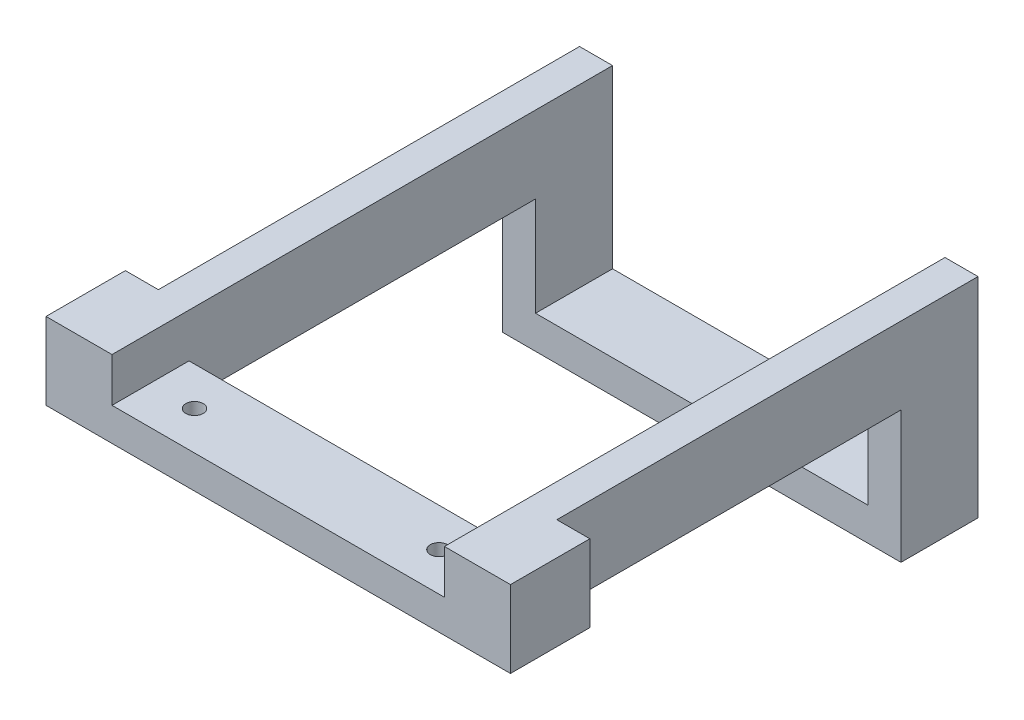
ISO-10303-21;
HEADER;
FILE_DESCRIPTION(('STEP AP214'),'2;1');
FILE_NAME('part.step','',(''),(''),'','','');
FILE_SCHEMA(('AUTOMOTIVE_DESIGN { 1 0 10303 214 1 1 1 1 }'));
ENDSEC;
DATA;
#1=APPLICATION_CONTEXT('core data for automotive mechanical design processes');
#2=APPLICATION_PROTOCOL_DEFINITION('international standard','automotive_design',2000,#1);
#3=PRODUCT_CONTEXT('',#1,'mechanical');
#4=PRODUCT('Part','Part','',(#3));
#5=PRODUCT_RELATED_PRODUCT_CATEGORY('part','',(#4));
#6=PRODUCT_DEFINITION_FORMATION('','',#4);
#7=PRODUCT_DEFINITION_CONTEXT('part definition',#1,'design');
#8=PRODUCT_DEFINITION('design','',#6,#7);
#9=PRODUCT_DEFINITION_SHAPE('','',#8);
#10=(LENGTH_UNIT() NAMED_UNIT(*) SI_UNIT(.MILLI.,.METRE.));
#11=(NAMED_UNIT(*) PLANE_ANGLE_UNIT() SI_UNIT($,.RADIAN.));
#12=(NAMED_UNIT(*) SI_UNIT($,.STERADIAN.) SOLID_ANGLE_UNIT());
#13=UNCERTAINTY_MEASURE_WITH_UNIT(LENGTH_MEASURE(1.E-05),#10,'distance_accuracy_value','');
#14=(GEOMETRIC_REPRESENTATION_CONTEXT(3) GLOBAL_UNCERTAINTY_ASSIGNED_CONTEXT((#13)) GLOBAL_UNIT_ASSIGNED_CONTEXT((#10,
#11,#12)) REPRESENTATION_CONTEXT('',''));
#15=CARTESIAN_POINT('',(0.,0.,0.));
#16=DIRECTION('',(0.,0.,1.));
#17=DIRECTION('',(1.,0.,0.));
#18=AXIS2_PLACEMENT_3D('',#15,#16,#17);
#19=CARTESIAN_POINT('',(191.9,948.1,-44.45));
#20=DIRECTION('',(1.,0.,0.));
#21=DIRECTION('',(0.,0.,-1.));
#22=AXIS2_PLACEMENT_3D('',#19,#20,#21);
#23=PLANE('',#22);
#24=DIRECTION('',(0.,1.,0.));
#25=VECTOR('',#24,1.);
#26=CARTESIAN_POINT('',(191.9,948.1,444.5));
#27=LINE('',#26,#25);
#28=CARTESIAN_POINT('',(191.9,948.1,444.5));
#29=VERTEX_POINT('',#28);
#30=CARTESIAN_POINT('',(191.9,986.2,444.5));
#31=VERTEX_POINT('',#30);
#32=EDGE_CURVE('E156',#29,#31,#27,.T.);
#33=ORIENTED_EDGE('',*,*,#32,.T.);
#34=DIRECTION('',(0.,0.,1.));
#35=VECTOR('',#34,1.);
#36=CARTESIAN_POINT('',(191.9,986.2,533.4));
#37=LINE('',#36,#35);
#38=CARTESIAN_POINT('',(191.9,986.2,533.4));
#39=VERTEX_POINT('',#38);
#40=EDGE_CURVE('E50',#31,#39,#37,.T.);
#41=ORIENTED_EDGE('',*,*,#40,.T.);
#42=DIRECTION('',(0.,1.,0.));
#43=VECTOR('',#42,1.);
#44=CARTESIAN_POINT('',(191.9,948.1,533.4));
#45=LINE('',#44,#43);
#46=CARTESIAN_POINT('',(191.9,1037.,533.4));
#47=VERTEX_POINT('',#46);
#48=EDGE_CURVE('E275',#39,#47,#45,.T.);
#49=ORIENTED_EDGE('',*,*,#48,.T.);
#50=DIRECTION('',(0.,0.,-1.));
#51=VECTOR('',#50,1.);
#52=CARTESIAN_POINT('',(191.9,1037.,533.4));
#53=LINE('',#52,#51);
#54=CARTESIAN_POINT('',(191.9,1037.,-44.45));
#55=VERTEX_POINT('',#54);
#56=EDGE_CURVE('E281',#47,#55,#53,.T.);
#57=ORIENTED_EDGE('',*,*,#56,.T.);
#58=DIRECTION('',(0.,-1.,0.));
#59=VECTOR('',#58,1.);
#60=CARTESIAN_POINT('',(191.9,948.1,-44.45));
#61=LINE('',#60,#59);
#62=CARTESIAN_POINT('',(191.9,833.8,-44.45));
#63=VERTEX_POINT('',#62);
#64=EDGE_CURVE('E297',#55,#63,#61,.T.);
#65=ORIENTED_EDGE('',*,*,#64,.T.);
#66=DIRECTION('',(0.,0.,1.));
#67=VECTOR('',#66,1.);
#68=CARTESIAN_POINT('',(191.9,833.8,-44.45));
#69=LINE('',#68,#67);
#70=CARTESIAN_POINT('',(191.9,833.8,44.45));
#71=VERTEX_POINT('',#70);
#72=EDGE_CURVE('E243',#63,#71,#69,.T.);
#73=ORIENTED_EDGE('',*,*,#72,.T.);
#74=DIRECTION('',(0.,-1.,0.));
#75=VECTOR('',#74,1.);
#76=CARTESIAN_POINT('',(191.9,948.1,44.45));
#77=LINE('',#76,#75);
#78=CARTESIAN_POINT('',(191.9,948.1,44.45));
#79=VERTEX_POINT('',#78);
#80=EDGE_CURVE('E294',#79,#71,#77,.T.);
#81=ORIENTED_EDGE('',*,*,#80,.F.);
#82=DIRECTION('',(0.,0.,-1.));
#83=VECTOR('',#82,1.);
#84=CARTESIAN_POINT('',(191.9,948.1,533.4));
#85=LINE('',#84,#83);
#86=EDGE_CURVE('E56',#29,#79,#85,.T.);
#87=ORIENTED_EDGE('',*,*,#86,.F.);
#88=EDGE_LOOP('',(#33,#41,#49,#57,#65,#73,#81,#87));
#89=FACE_BOUND('',#88,.T.);
#90=ADVANCED_FACE('F35',(#89),#23,.F.);
#91=CARTESIAN_POINT('',(-191.9,948.1,-44.45));
#92=DIRECTION('',(-1.,0.,0.));
#93=DIRECTION('',(0.,0.,1.));
#94=AXIS2_PLACEMENT_3D('',#91,#92,#93);
#95=PLANE('',#94);
#96=DIRECTION('',(0.,1.,0.));
#97=VECTOR('',#96,1.);
#98=CARTESIAN_POINT('',(-191.9,948.1,444.5));
#99=LINE('',#98,#97);
#100=CARTESIAN_POINT('',(-191.9,948.1,444.5));
#101=VERTEX_POINT('',#100);
#102=CARTESIAN_POINT('',(-191.9,986.2,444.5));
#103=VERTEX_POINT('',#102);
#104=EDGE_CURVE('E167',#101,#103,#99,.T.);
#105=ORIENTED_EDGE('',*,*,#104,.F.);
#106=DIRECTION('',(0.,0.,-1.));
#107=VECTOR('',#106,1.);
#108=CARTESIAN_POINT('',(-191.9,948.1,533.4));
#109=LINE('',#108,#107);
#110=CARTESIAN_POINT('',(-191.9,948.1,44.45));
#111=VERTEX_POINT('',#110);
#112=EDGE_CURVE('E207',#101,#111,#109,.T.);
#113=ORIENTED_EDGE('',*,*,#112,.T.);
#114=DIRECTION('',(0.,-1.,0.));
#115=VECTOR('',#114,1.);
#116=CARTESIAN_POINT('',(-191.9,948.1,44.45));
#117=LINE('',#116,#115);
#118=CARTESIAN_POINT('',(-191.9,833.8,44.45));
#119=VERTEX_POINT('',#118);
#120=EDGE_CURVE('E196',#111,#119,#117,.T.);
#121=ORIENTED_EDGE('',*,*,#120,.T.);
#122=DIRECTION('',(0.,0.,1.));
#123=VECTOR('',#122,1.);
#124=CARTESIAN_POINT('',(-191.9,833.8,-44.45));
#125=LINE('',#124,#123);
#126=CARTESIAN_POINT('',(-191.9,833.8,-44.45));
#127=VERTEX_POINT('',#126);
#128=EDGE_CURVE('E239',#127,#119,#125,.T.);
#129=ORIENTED_EDGE('',*,*,#128,.F.);
#130=DIRECTION('',(0.,-1.,0.));
#131=VECTOR('',#130,1.);
#132=CARTESIAN_POINT('',(-191.9,948.1,-44.45));
#133=LINE('',#132,#131);
#134=CARTESIAN_POINT('',(-191.9,1037.,-44.45));
#135=VERTEX_POINT('',#134);
#136=EDGE_CURVE('E200',#135,#127,#133,.T.);
#137=ORIENTED_EDGE('',*,*,#136,.F.);
#138=DIRECTION('',(0.,0.,-1.));
#139=VECTOR('',#138,1.);
#140=CARTESIAN_POINT('',(-191.9,1037.,533.4));
#141=LINE('',#140,#139);
#142=CARTESIAN_POINT('',(-191.9,1037.,533.4));
#143=VERTEX_POINT('',#142);
#144=EDGE_CURVE('E210',#143,#135,#141,.T.);
#145=ORIENTED_EDGE('',*,*,#144,.F.);
#146=DIRECTION('',(0.,-1.,0.));
#147=VECTOR('',#146,1.);
#148=CARTESIAN_POINT('',(-191.9,948.1,533.4));
#149=LINE('',#148,#147);
#150=CARTESIAN_POINT('',(-191.9,986.2,533.4));
#151=VERTEX_POINT('',#150);
#152=EDGE_CURVE('E198',#143,#151,#149,.T.);
#153=ORIENTED_EDGE('',*,*,#152,.T.);
#154=DIRECTION('',(0.,0.,1.));
#155=VECTOR('',#154,1.);
#156=CARTESIAN_POINT('',(-191.9,986.2,533.4));
#157=LINE('',#156,#155);
#158=EDGE_CURVE('E170',#103,#151,#157,.T.);
#159=ORIENTED_EDGE('',*,*,#158,.F.);
#160=EDGE_LOOP('',(#105,#113,#121,#129,#137,#145,#153,#159));
#161=FACE_BOUND('',#160,.T.);
#162=ADVANCED_FACE('F319',(#161),#95,.F.);
#163=CARTESIAN_POINT('',(230.,38.1,44.45));
#164=DIRECTION('',(-1.,0.,0.));
#165=DIRECTION('',(0.,0.,1.));
#166=AXIS2_PLACEMENT_3D('',#163,#164,#165);
#167=PLANE('',#166);
#168=DIRECTION('',(0.,0.,-1.));
#169=VECTOR('',#168,1.);
#170=CARTESIAN_POINT('',(230.,948.1,533.4));
#171=LINE('',#170,#169);
#172=CARTESIAN_POINT('',(230.,948.1,441.768705907094));
#173=VERTEX_POINT('',#172);
#174=CARTESIAN_POINT('',(230.,948.1,44.45));
#175=VERTEX_POINT('',#174);
#176=EDGE_CURVE('E286',#173,#175,#171,.T.);
#177=ORIENTED_EDGE('',*,*,#176,.T.);
#178=DIRECTION('',(0.,-1.,0.));
#179=VECTOR('',#178,1.);
#180=CARTESIAN_POINT('',(230.,38.1,44.45));
#181=LINE('',#180,#179);
#182=CARTESIAN_POINT('',(230.,795.7,44.4499999999999));
#183=VERTEX_POINT('',#182);
#184=EDGE_CURVE('E43',#175,#183,#181,.T.);
#185=ORIENTED_EDGE('',*,*,#184,.T.);
#186=DIRECTION('',(0.,0.,1.));
#187=VECTOR('',#186,1.);
#188=CARTESIAN_POINT('',(230.,795.7,-1507.78252871268));
#189=LINE('',#188,#187);
#190=CARTESIAN_POINT('',(230.,795.7,-44.4500000000001));
#191=VERTEX_POINT('',#190);
#192=EDGE_CURVE('E246',#191,#183,#189,.T.);
#193=ORIENTED_EDGE('',*,*,#192,.F.);
#194=DIRECTION('',(0.,-1.,0.));
#195=VECTOR('',#194,1.);
#196=CARTESIAN_POINT('',(230.,38.1,-44.45));
#197=LINE('',#196,#195);
#198=CARTESIAN_POINT('',(230.,1037.,-44.45));
#199=VERTEX_POINT('',#198);
#200=EDGE_CURVE('E300',#199,#191,#197,.T.);
#201=ORIENTED_EDGE('',*,*,#200,.F.);
#202=DIRECTION('',(0.,0.,-1.));
#203=VECTOR('',#202,1.);
#204=CARTESIAN_POINT('',(230.,1037.,533.4));
#205=LINE('',#204,#203);
#206=CARTESIAN_POINT('',(230.,1037.,441.768705907094));
#207=VERTEX_POINT('',#206);
#208=EDGE_CURVE('E288',#207,#199,#205,.T.);
#209=ORIENTED_EDGE('',*,*,#208,.F.);
#210=DIRECTION('',(0.,-1.,0.));
#211=VECTOR('',#210,1.);
#212=CARTESIAN_POINT('',(230.,1136.23660643704,441.768705907094));
#213=LINE('',#212,#211);
#214=EDGE_CURVE('E261',#207,#173,#213,.T.);
#215=ORIENTED_EDGE('',*,*,#214,.T.);
#216=EDGE_LOOP('',(#177,#185,#193,#201,#209,#215));
#217=FACE_BOUND('',#216,.T.);
#218=ADVANCED_FACE('F305',(#217),#167,.F.);
#219=CARTESIAN_POINT('',(191.9,1037.,533.4));
#220=DIRECTION('',(0.,1.,0.));
#221=DIRECTION('',(0.,0.,1.));
#222=AXIS2_PLACEMENT_3D('',#219,#220,#221);
#223=PLANE('',#222);
#224=DIRECTION('',(1.,0.,0.));
#225=VECTOR('',#224,1.);
#226=CARTESIAN_POINT('',(191.9,1037.,-44.45));
#227=LINE('',#226,#225);
#228=EDGE_CURVE('E274',#55,#199,#227,.T.);
#229=ORIENTED_EDGE('',*,*,#228,.F.);
#230=ORIENTED_EDGE('',*,*,#56,.F.);
#231=DIRECTION('',(1.,0.,0.));
#232=VECTOR('',#231,1.);
#233=CARTESIAN_POINT('',(191.9,1037.,533.4));
#234=LINE('',#233,#232);
#235=CARTESIAN_POINT('',(268.1,1037.,533.4));
#236=VERTEX_POINT('',#235);
#237=EDGE_CURVE('E277',#47,#236,#234,.T.);
#238=ORIENTED_EDGE('',*,*,#237,.T.);
#239=DIRECTION('',(0.,0.,-1.));
#240=VECTOR('',#239,1.);
#241=CARTESIAN_POINT('',(268.1,1037.,533.4));
#242=LINE('',#241,#240);
#243=CARTESIAN_POINT('',(268.1,1037.,441.768705907094));
#244=VERTEX_POINT('',#243);
#245=EDGE_CURVE('E264',#236,#244,#242,.T.);
#246=ORIENTED_EDGE('',*,*,#245,.T.);
#247=DIRECTION('',(1.,0.,0.));
#248=VECTOR('',#247,1.);
#249=CARTESIAN_POINT('',(230.,1037.,441.768705907094));
#250=LINE('',#249,#248);
#251=EDGE_CURVE('E265',#207,#244,#250,.T.);
#252=ORIENTED_EDGE('',*,*,#251,.F.);
#253=ORIENTED_EDGE('',*,*,#208,.T.);
#254=EDGE_LOOP('',(#229,#230,#238,#246,#252,#253));
#255=FACE_BOUND('',#254,.T.);
#256=ADVANCED_FACE('F343',(#255),#223,.T.);
#257=CARTESIAN_POINT('',(268.1,1136.23660643704,533.4));
#258=DIRECTION('',(-1.,0.,0.));
#259=DIRECTION('',(0.,0.,1.));
#260=AXIS2_PLACEMENT_3D('',#257,#258,#259);
#261=PLANE('',#260);
#262=DIRECTION('',(0.,-1.,0.));
#263=VECTOR('',#262,1.);
#264=CARTESIAN_POINT('',(268.1,1136.23660643704,533.4));
#265=LINE('',#264,#263);
#266=CARTESIAN_POINT('',(268.1,948.1,533.4));
#267=VERTEX_POINT('',#266);
#268=EDGE_CURVE('E260',#236,#267,#265,.T.);
#269=ORIENTED_EDGE('',*,*,#268,.T.);
#270=DIRECTION('',(0.,0.,-1.));
#271=VECTOR('',#270,1.);
#272=CARTESIAN_POINT('',(268.1,948.1,533.4));
#273=LINE('',#272,#271);
#274=CARTESIAN_POINT('',(268.1,948.1,441.768705907094));
#275=VERTEX_POINT('',#274);
#276=EDGE_CURVE('E11',#267,#275,#273,.T.);
#277=ORIENTED_EDGE('',*,*,#276,.T.);
#278=DIRECTION('',(0.,-1.,0.));
#279=VECTOR('',#278,1.);
#280=CARTESIAN_POINT('',(268.1,1136.23660643704,441.768705907094));
#281=LINE('',#280,#279);
#282=EDGE_CURVE('E266',#244,#275,#281,.T.);
#283=ORIENTED_EDGE('',*,*,#282,.F.);
#284=ORIENTED_EDGE('',*,*,#245,.F.);
#285=EDGE_LOOP('',(#269,#277,#283,#284));
#286=FACE_BOUND('',#285,.T.);
#287=ADVANCED_FACE('F351',(#286),#261,.F.);
#288=CARTESIAN_POINT('',(0.,1136.23660643704,441.768705907094));
#289=DIRECTION('',(0.,0.,1.));
#290=DIRECTION('',(1.,0.,0.));
#291=AXIS2_PLACEMENT_3D('',#288,#289,#290);
#292=PLANE('',#291);
#293=ORIENTED_EDGE('',*,*,#282,.T.);
#294=DIRECTION('',(-1.,0.,0.));
#295=VECTOR('',#294,1.);
#296=CARTESIAN_POINT('',(0.,948.1,441.768705907094));
#297=LINE('',#296,#295);
#298=EDGE_CURVE('E254',#275,#173,#297,.T.);
#299=ORIENTED_EDGE('',*,*,#298,.T.);
#300=ORIENTED_EDGE('',*,*,#214,.F.);
#301=ORIENTED_EDGE('',*,*,#251,.T.);
#302=EDGE_LOOP('',(#293,#299,#300,#301));
#303=FACE_BOUND('',#302,.T.);
#304=ADVANCED_FACE('F348',(#303),#292,.F.);
#305=CARTESIAN_POINT('',(191.9,948.1,533.4));
#306=DIRECTION('',(0.,-1.,0.));
#307=DIRECTION('',(0.,0.,-1.));
#308=AXIS2_PLACEMENT_3D('',#305,#306,#307);
#309=PLANE('',#308);
#310=CARTESIAN_POINT('',(-141.1,948.1,488.95));
#311=DIRECTION('',(0.,-1.,0.));
#312=DIRECTION('',(0.,0.,-1.));
#313=AXIS2_PLACEMENT_3D('',#310,#311,#312);
#314=CIRCLE('',#313,10.);
#315=CARTESIAN_POINT('',(-141.1,948.1,478.95));
#316=VERTEX_POINT('',#315);
#317=EDGE_CURVE('E413',#316,#316,#314,.T.);
#318=ORIENTED_EDGE('',*,*,#317,.F.);
#319=EDGE_LOOP('',(#318));
#320=FACE_BOUND('',#319,.T.);
#321=CARTESIAN_POINT('',(141.1,948.1,488.95));
#322=DIRECTION('',(0.,-1.,0.));
#323=DIRECTION('',(0.,0.,-1.));
#324=AXIS2_PLACEMENT_3D('',#321,#322,#323);
#325=CIRCLE('',#324,10.);
#326=CARTESIAN_POINT('',(141.1,948.1,478.95));
#327=VERTEX_POINT('',#326);
#328=EDGE_CURVE('E404',#327,#327,#325,.T.);
#329=ORIENTED_EDGE('',*,*,#328,.F.);
#330=EDGE_LOOP('',(#329));
#331=FACE_BOUND('',#330,.T.);
#332=DIRECTION('',(1.,0.,0.));
#333=VECTOR('',#332,1.);
#334=CARTESIAN_POINT('',(230.,948.1,44.45));
#335=LINE('',#334,#333);
#336=EDGE_CURVE('E285',#79,#175,#335,.T.);
#337=ORIENTED_EDGE('',*,*,#336,.T.);
#338=ORIENTED_EDGE('',*,*,#176,.F.);
#339=ORIENTED_EDGE('',*,*,#298,.F.);
#340=ORIENTED_EDGE('',*,*,#276,.F.);
#341=DIRECTION('',(-1.,0.,0.));
#342=VECTOR('',#341,1.);
#343=CARTESIAN_POINT('',(191.9,948.1,533.4));
#344=LINE('',#343,#342);
#345=CARTESIAN_POINT('',(-268.1,948.1,533.4));
#346=VERTEX_POINT('',#345);
#347=EDGE_CURVE('E279',#267,#346,#344,.T.);
#348=ORIENTED_EDGE('',*,*,#347,.T.);
#349=DIRECTION('',(0.,0.,1.));
#350=VECTOR('',#349,1.);
#351=CARTESIAN_POINT('',(-268.1,948.1,-1507.78252871268));
#352=LINE('',#351,#350);
#353=CARTESIAN_POINT('',(-268.1,948.1,441.768705907094));
#354=VERTEX_POINT('',#353);
#355=EDGE_CURVE('E225',#354,#346,#352,.T.);
#356=ORIENTED_EDGE('',*,*,#355,.F.);
#357=DIRECTION('',(-1.,0.,0.));
#358=VECTOR('',#357,1.);
#359=CARTESIAN_POINT('',(0.,948.1,441.768705907094));
#360=LINE('',#359,#358);
#361=CARTESIAN_POINT('',(-230.,948.1,441.768705907094));
#362=VERTEX_POINT('',#361);
#363=EDGE_CURVE('E184',#362,#354,#360,.T.);
#364=ORIENTED_EDGE('',*,*,#363,.F.);
#365=DIRECTION('',(0.,0.,-1.));
#366=VECTOR('',#365,1.);
#367=CARTESIAN_POINT('',(-230.,948.1,533.4));
#368=LINE('',#367,#366);
#369=CARTESIAN_POINT('',(-230.,948.1,44.45));
#370=VERTEX_POINT('',#369);
#371=EDGE_CURVE('E206',#362,#370,#368,.T.);
#372=ORIENTED_EDGE('',*,*,#371,.T.);
#373=DIRECTION('',(1.,0.,0.));
#374=VECTOR('',#373,1.);
#375=CARTESIAN_POINT('',(-230.,948.1,44.45));
#376=LINE('',#375,#374);
#377=EDGE_CURVE('E203',#370,#111,#376,.T.);
#378=ORIENTED_EDGE('',*,*,#377,.T.);
#379=ORIENTED_EDGE('',*,*,#112,.F.);
#380=DIRECTION('',(-1.,0.,0.));
#381=VECTOR('',#380,1.);
#382=CARTESIAN_POINT('',(288.620318444472,948.1,444.5));
#383=LINE('',#382,#381);
#384=EDGE_CURVE('E180',#29,#101,#383,.T.);
#385=ORIENTED_EDGE('',*,*,#384,.F.);
#386=ORIENTED_EDGE('',*,*,#86,.T.);
#387=EDGE_LOOP('',(#337,#338,#339,#340,#348,#356,#364,#372,#378,#379,#385,#386));
#388=FACE_BOUND('',#387,.T.);
#389=ADVANCED_FACE('F311',(#320,#331,#388),#309,.T.);
#390=CARTESIAN_POINT('',(0.,0.,533.4));
#391=DIRECTION('',(0.,0.,-1.));
#392=DIRECTION('',(-1.,0.,0.));
#393=AXIS2_PLACEMENT_3D('',#390,#391,#392);
#394=PLANE('',#393);
#395=ORIENTED_EDGE('',*,*,#347,.F.);
#396=ORIENTED_EDGE('',*,*,#268,.F.);
#397=ORIENTED_EDGE('',*,*,#237,.F.);
#398=ORIENTED_EDGE('',*,*,#48,.F.);
#399=DIRECTION('',(-1.,0.,0.));
#400=VECTOR('',#399,1.);
#401=CARTESIAN_POINT('',(288.620318444472,986.2,533.4));
#402=LINE('',#401,#400);
#403=EDGE_CURVE('E175',#39,#151,#402,.T.);
#404=ORIENTED_EDGE('',*,*,#403,.T.);
#405=ORIENTED_EDGE('',*,*,#152,.F.);
#406=DIRECTION('',(1.,0.,0.));
#407=VECTOR('',#406,1.);
#408=CARTESIAN_POINT('',(-230.,1037.,533.4));
#409=LINE('',#408,#407);
#410=CARTESIAN_POINT('',(-268.1,1037.,533.4));
#411=VERTEX_POINT('',#410);
#412=EDGE_CURVE('E214',#411,#143,#409,.T.);
#413=ORIENTED_EDGE('',*,*,#412,.F.);
#414=DIRECTION('',(0.,-1.,0.));
#415=VECTOR('',#414,1.);
#416=CARTESIAN_POINT('',(-268.1,1136.23660643704,533.4));
#417=LINE('',#416,#415);
#418=EDGE_CURVE('E213',#411,#346,#417,.T.);
#419=ORIENTED_EDGE('',*,*,#418,.T.);
#420=EDGE_LOOP('',(#395,#396,#397,#398,#404,#405,#413,#419));
#421=FACE_BOUND('',#420,.T.);
#422=ADVANCED_FACE('F330',(#421),#394,.F.);
#423=CARTESIAN_POINT('',(230.,38.1,-44.45));
#424=DIRECTION('',(0.,0.,1.));
#425=DIRECTION('',(1.,0.,0.));
#426=AXIS2_PLACEMENT_3D('',#423,#424,#425);
#427=PLANE('',#426);
#428=ORIENTED_EDGE('',*,*,#200,.T.);
#429=DIRECTION('',(1.,0.,0.));
#430=VECTOR('',#429,1.);
#431=CARTESIAN_POINT('',(0.,795.7,-44.4500000000001));
#432=LINE('',#431,#430);
#433=CARTESIAN_POINT('',(-230.,795.7,-44.4500000000001));
#434=VERTEX_POINT('',#433);
#435=EDGE_CURVE('E251',#434,#191,#432,.T.);
#436=ORIENTED_EDGE('',*,*,#435,.F.);
#437=DIRECTION('',(0.,-1.,0.));
#438=VECTOR('',#437,1.);
#439=CARTESIAN_POINT('',(-230.,38.1,-44.45));
#440=LINE('',#439,#438);
#441=CARTESIAN_POINT('',(-230.,1037.,-44.45));
#442=VERTEX_POINT('',#441);
#443=EDGE_CURVE('E161',#442,#434,#440,.T.);
#444=ORIENTED_EDGE('',*,*,#443,.F.);
#445=DIRECTION('',(1.,0.,0.));
#446=VECTOR('',#445,1.);
#447=CARTESIAN_POINT('',(-230.,1037.,-44.45));
#448=LINE('',#447,#446);
#449=EDGE_CURVE('E199',#442,#135,#448,.T.);
#450=ORIENTED_EDGE('',*,*,#449,.T.);
#451=ORIENTED_EDGE('',*,*,#136,.T.);
#452=DIRECTION('',(-1.,0.,0.));
#453=VECTOR('',#452,1.);
#454=CARTESIAN_POINT('',(288.620318444472,833.8,-44.45));
#455=LINE('',#454,#453);
#456=EDGE_CURVE('E187',#63,#127,#455,.T.);
#457=ORIENTED_EDGE('',*,*,#456,.F.);
#458=ORIENTED_EDGE('',*,*,#64,.F.);
#459=ORIENTED_EDGE('',*,*,#228,.T.);
#460=EDGE_LOOP('',(#428,#436,#444,#450,#451,#457,#458,#459));
#461=FACE_BOUND('',#460,.T.);
#462=ADVANCED_FACE('F321',(#461),#427,.F.);
#463=CARTESIAN_POINT('',(230.,38.1,44.45));
#464=DIRECTION('',(0.,0.,-1.));
#465=DIRECTION('',(-1.,0.,0.));
#466=AXIS2_PLACEMENT_3D('',#463,#464,#465);
#467=PLANE('',#466);
#468=ORIENTED_EDGE('',*,*,#80,.T.);
#469=DIRECTION('',(-1.,0.,0.));
#470=VECTOR('',#469,1.);
#471=CARTESIAN_POINT('',(288.620318444472,833.8,44.45));
#472=LINE('',#471,#470);
#473=EDGE_CURVE('E242',#71,#119,#472,.T.);
#474=ORIENTED_EDGE('',*,*,#473,.T.);
#475=ORIENTED_EDGE('',*,*,#120,.F.);
#476=ORIENTED_EDGE('',*,*,#377,.F.);
#477=DIRECTION('',(0.,-1.,0.));
#478=VECTOR('',#477,1.);
#479=CARTESIAN_POINT('',(-230.,38.1,44.45));
#480=LINE('',#479,#478);
#481=CARTESIAN_POINT('',(-230.,795.7,44.4500000000001));
#482=VERTEX_POINT('',#481);
#483=EDGE_CURVE('E189',#370,#482,#480,.T.);
#484=ORIENTED_EDGE('',*,*,#483,.T.);
#485=DIRECTION('',(1.,0.,0.));
#486=VECTOR('',#485,1.);
#487=CARTESIAN_POINT('',(230.,795.7,44.45));
#488=LINE('',#487,#486);
#489=EDGE_CURVE('E257',#482,#183,#488,.T.);
#490=ORIENTED_EDGE('',*,*,#489,.T.);
#491=ORIENTED_EDGE('',*,*,#184,.F.);
#492=ORIENTED_EDGE('',*,*,#336,.F.);
#493=EDGE_LOOP('',(#468,#474,#475,#476,#484,#490,#491,#492));
#494=FACE_BOUND('',#493,.T.);
#495=ADVANCED_FACE('F37',(#494),#467,.F.);
#496=CARTESIAN_POINT('',(-1.04487122107274E-13,795.7,-1507.78252871268));
#497=DIRECTION('',(0.,1.,0.));
#498=DIRECTION('',(-1.,0.,0.));
#499=AXIS2_PLACEMENT_3D('',#496,#497,#498);
#500=PLANE('',#499);
#501=CARTESIAN_POINT('',(0.,795.7,0.));
#502=DIRECTION('',(0.,-1.,0.));
#503=DIRECTION('',(1.,0.,0.));
#504=AXIS2_PLACEMENT_3D('',#501,#502,#503);
#505=CIRCLE('',#504,10.);
#506=CARTESIAN_POINT('',(10.,795.7,0.));
#507=VERTEX_POINT('',#506);
#508=EDGE_CURVE('E405',#507,#507,#505,.T.);
#509=ORIENTED_EDGE('',*,*,#508,.F.);
#510=EDGE_LOOP('',(#509));
#511=FACE_BOUND('',#510,.T.);
#512=ORIENTED_EDGE('',*,*,#489,.F.);
#513=DIRECTION('',(0.,0.,1.));
#514=VECTOR('',#513,1.);
#515=CARTESIAN_POINT('',(-230.,795.7,-1507.78252871268));
#516=LINE('',#515,#514);
#517=EDGE_CURVE('E193',#434,#482,#516,.T.);
#518=ORIENTED_EDGE('',*,*,#517,.F.);
#519=ORIENTED_EDGE('',*,*,#435,.T.);
#520=ORIENTED_EDGE('',*,*,#192,.T.);
#521=EDGE_LOOP('',(#512,#518,#519,#520));
#522=FACE_BOUND('',#521,.T.);
#523=ADVANCED_FACE('F338',(#511,#522),#500,.F.);
#524=CARTESIAN_POINT('',(288.620318444472,833.8,-44.45));
#525=DIRECTION('',(0.,-1.,0.));
#526=DIRECTION('',(0.,0.,-1.));
#527=AXIS2_PLACEMENT_3D('',#524,#525,#526);
#528=PLANE('',#527);
#529=CARTESIAN_POINT('',(0.,833.8,0.));
#530=DIRECTION('',(0.,-1.,0.));
#531=DIRECTION('',(0.,0.,-1.));
#532=AXIS2_PLACEMENT_3D('',#529,#530,#531);
#533=CIRCLE('',#532,10.);
#534=CARTESIAN_POINT('',(0.,833.8,-10.0000000000001));
#535=VERTEX_POINT('',#534);
#536=EDGE_CURVE('E402',#535,#535,#533,.F.);
#537=ORIENTED_EDGE('',*,*,#536,.F.);
#538=EDGE_LOOP('',(#537));
#539=FACE_BOUND('',#538,.T.);
#540=ORIENTED_EDGE('',*,*,#72,.F.);
#541=ORIENTED_EDGE('',*,*,#456,.T.);
#542=ORIENTED_EDGE('',*,*,#128,.T.);
#543=ORIENTED_EDGE('',*,*,#473,.F.);
#544=EDGE_LOOP('',(#540,#541,#542,#543));
#545=FACE_BOUND('',#544,.T.);
#546=ADVANCED_FACE('F316',(#539,#545),#528,.F.);
#547=CARTESIAN_POINT('',(-230.,38.1,44.45));
#548=DIRECTION('',(1.,0.,0.));
#549=DIRECTION('',(0.,0.,-1.));
#550=AXIS2_PLACEMENT_3D('',#547,#548,#549);
#551=PLANE('',#550);
#552=ORIENTED_EDGE('',*,*,#443,.T.);
#553=ORIENTED_EDGE('',*,*,#517,.T.);
#554=ORIENTED_EDGE('',*,*,#483,.F.);
#555=ORIENTED_EDGE('',*,*,#371,.F.);
#556=DIRECTION('',(0.,-1.,0.));
#557=VECTOR('',#556,1.);
#558=CARTESIAN_POINT('',(-230.,1136.23660643704,441.768705907094));
#559=LINE('',#558,#557);
#560=CARTESIAN_POINT('',(-230.,1037.,441.768705907094));
#561=VERTEX_POINT('',#560);
#562=EDGE_CURVE('E188',#561,#362,#559,.T.);
#563=ORIENTED_EDGE('',*,*,#562,.F.);
#564=DIRECTION('',(0.,0.,-1.));
#565=VECTOR('',#564,1.);
#566=CARTESIAN_POINT('',(-230.,1037.,533.4));
#567=LINE('',#566,#565);
#568=EDGE_CURVE('E192',#561,#442,#567,.T.);
#569=ORIENTED_EDGE('',*,*,#568,.T.);
#570=EDGE_LOOP('',(#552,#553,#554,#555,#563,#569));
#571=FACE_BOUND('',#570,.T.);
#572=ADVANCED_FACE('F335',(#571),#551,.F.);
#573=CARTESIAN_POINT('',(-230.,1037.,533.4));
#574=DIRECTION('',(0.,1.,0.));
#575=DIRECTION('',(0.,0.,1.));
#576=AXIS2_PLACEMENT_3D('',#573,#574,#575);
#577=PLANE('',#576);
#578=ORIENTED_EDGE('',*,*,#449,.F.);
#579=ORIENTED_EDGE('',*,*,#568,.F.);
#580=DIRECTION('',(-1.,0.,0.));
#581=VECTOR('',#580,1.);
#582=CARTESIAN_POINT('',(0.,1037.,441.768705907094));
#583=LINE('',#582,#581);
#584=CARTESIAN_POINT('',(-268.1,1037.,441.768705907094));
#585=VERTEX_POINT('',#584);
#586=EDGE_CURVE('E217',#561,#585,#583,.T.);
#587=ORIENTED_EDGE('',*,*,#586,.T.);
#588=DIRECTION('',(0.,0.,-1.));
#589=VECTOR('',#588,1.);
#590=CARTESIAN_POINT('',(-268.1,1037.,0.));
#591=LINE('',#590,#589);
#592=EDGE_CURVE('E229',#411,#585,#591,.T.);
#593=ORIENTED_EDGE('',*,*,#592,.F.);
#594=ORIENTED_EDGE('',*,*,#412,.T.);
#595=ORIENTED_EDGE('',*,*,#144,.T.);
#596=EDGE_LOOP('',(#578,#579,#587,#593,#594,#595));
#597=FACE_BOUND('',#596,.T.);
#598=ADVANCED_FACE('F325',(#597),#577,.T.);
#599=CARTESIAN_POINT('',(-268.1,1136.23660643704,0.));
#600=DIRECTION('',(-1.,0.,0.));
#601=DIRECTION('',(0.,0.,1.));
#602=AXIS2_PLACEMENT_3D('',#599,#600,#601);
#603=PLANE('',#602);
#604=ORIENTED_EDGE('',*,*,#355,.T.);
#605=ORIENTED_EDGE('',*,*,#418,.F.);
#606=ORIENTED_EDGE('',*,*,#592,.T.);
#607=DIRECTION('',(0.,-1.,0.));
#608=VECTOR('',#607,1.);
#609=CARTESIAN_POINT('',(-268.1,1136.23660643704,441.768705907094));
#610=LINE('',#609,#608);
#611=EDGE_CURVE('E226',#585,#354,#610,.T.);
#612=ORIENTED_EDGE('',*,*,#611,.T.);
#613=EDGE_LOOP('',(#604,#605,#606,#612));
#614=FACE_BOUND('',#613,.T.);
#615=ADVANCED_FACE('F355',(#614),#603,.T.);
#616=CARTESIAN_POINT('',(0.,1136.23660643704,441.768705907094));
#617=DIRECTION('',(0.,0.,1.));
#618=DIRECTION('',(1.,0.,0.));
#619=AXIS2_PLACEMENT_3D('',#616,#617,#618);
#620=PLANE('',#619);
#621=ORIENTED_EDGE('',*,*,#562,.T.);
#622=ORIENTED_EDGE('',*,*,#363,.T.);
#623=ORIENTED_EDGE('',*,*,#611,.F.);
#624=ORIENTED_EDGE('',*,*,#586,.F.);
#625=EDGE_LOOP('',(#621,#622,#623,#624));
#626=FACE_BOUND('',#625,.T.);
#627=ADVANCED_FACE('F358',(#626),#620,.F.);
#628=CARTESIAN_POINT('',(288.620318444472,948.1,444.5));
#629=DIRECTION('',(0.,0.,1.));
#630=DIRECTION('',(1.,0.,0.));
#631=AXIS2_PLACEMENT_3D('',#628,#629,#630);
#632=PLANE('',#631);
#633=ORIENTED_EDGE('',*,*,#32,.F.);
#634=ORIENTED_EDGE('',*,*,#384,.T.);
#635=ORIENTED_EDGE('',*,*,#104,.T.);
#636=DIRECTION('',(-1.,0.,0.));
#637=VECTOR('',#636,1.);
#638=CARTESIAN_POINT('',(288.620318444472,986.2,444.5));
#639=LINE('',#638,#637);
#640=EDGE_CURVE('E165',#31,#103,#639,.T.);
#641=ORIENTED_EDGE('',*,*,#640,.F.);
#642=EDGE_LOOP('',(#633,#634,#635,#641));
#643=FACE_BOUND('',#642,.T.);
#644=ADVANCED_FACE('F166',(#643),#632,.F.);
#645=CARTESIAN_POINT('',(288.620318444472,986.2,533.4));
#646=DIRECTION('',(0.,-1.,0.));
#647=DIRECTION('',(0.,0.,-1.));
#648=AXIS2_PLACEMENT_3D('',#645,#646,#647);
#649=PLANE('',#648);
#650=CARTESIAN_POINT('',(-141.1,986.2,488.95));
#651=DIRECTION('',(0.,-1.,0.));
#652=DIRECTION('',(0.,0.,-1.));
#653=AXIS2_PLACEMENT_3D('',#650,#651,#652);
#654=CIRCLE('',#653,10.);
#655=CARTESIAN_POINT('',(-141.1,986.2,478.95));
#656=VERTEX_POINT('',#655);
#657=EDGE_CURVE('E183',#656,#656,#654,.F.);
#658=ORIENTED_EDGE('',*,*,#657,.F.);
#659=EDGE_LOOP('',(#658));
#660=FACE_BOUND('',#659,.T.);
#661=CARTESIAN_POINT('',(141.1,986.2,488.95));
#662=DIRECTION('',(0.,-1.,0.));
#663=DIRECTION('',(0.,0.,-1.));
#664=AXIS2_PLACEMENT_3D('',#661,#662,#663);
#665=CIRCLE('',#664,10.);
#666=CARTESIAN_POINT('',(141.1,986.2,478.95));
#667=VERTEX_POINT('',#666);
#668=EDGE_CURVE('E408',#667,#667,#665,.F.);
#669=ORIENTED_EDGE('',*,*,#668,.F.);
#670=EDGE_LOOP('',(#669));
#671=FACE_BOUND('',#670,.T.);
#672=ORIENTED_EDGE('',*,*,#40,.F.);
#673=ORIENTED_EDGE('',*,*,#640,.T.);
#674=ORIENTED_EDGE('',*,*,#158,.T.);
#675=ORIENTED_EDGE('',*,*,#403,.F.);
#676=EDGE_LOOP('',(#672,#673,#674,#675));
#677=FACE_BOUND('',#676,.T.);
#678=ADVANCED_FACE('F173',(#660,#671,#677),#649,.F.);
#679=CARTESIAN_POINT('',(141.1,1014.48427124746,488.95));
#680=DIRECTION('',(0.,-1.,0.));
#681=DIRECTION('',(0.,0.,-1.));
#682=AXIS2_PLACEMENT_3D('',#679,#680,#681);
#683=CYLINDRICAL_SURFACE('',#682,10.);
#684=ORIENTED_EDGE('',*,*,#668,.T.);
#685=EDGE_LOOP('',(#684));
#686=FACE_BOUND('',#685,.T.);
#687=ORIENTED_EDGE('',*,*,#328,.T.);
#688=EDGE_LOOP('',(#687));
#689=FACE_BOUND('',#688,.T.);
#690=ADVANCED_FACE('F421',(#686,#689),#683,.F.);
#691=CARTESIAN_POINT('',(-141.1,1014.48427124746,488.95));
#692=DIRECTION('',(0.,-1.,0.));
#693=DIRECTION('',(0.,0.,-1.));
#694=AXIS2_PLACEMENT_3D('',#691,#692,#693);
#695=CYLINDRICAL_SURFACE('',#694,10.);
#696=ORIENTED_EDGE('',*,*,#657,.T.);
#697=EDGE_LOOP('',(#696));
#698=FACE_BOUND('',#697,.T.);
#699=ORIENTED_EDGE('',*,*,#317,.T.);
#700=EDGE_LOOP('',(#699));
#701=FACE_BOUND('',#700,.T.);
#702=ADVANCED_FACE('F430',(#698,#701),#695,.F.);
#703=CARTESIAN_POINT('',(0.,862.084271247462,0.));
#704=DIRECTION('',(0.,-1.,0.));
#705=DIRECTION('',(1.,0.,0.));
#706=AXIS2_PLACEMENT_3D('',#703,#704,#705);
#707=CYLINDRICAL_SURFACE('',#706,10.);
#708=ORIENTED_EDGE('',*,*,#536,.T.);
#709=EDGE_LOOP('',(#708));
#710=FACE_BOUND('',#709,.T.);
#711=ORIENTED_EDGE('',*,*,#508,.T.);
#712=EDGE_LOOP('',(#711));
#713=FACE_BOUND('',#712,.T.);
#714=ADVANCED_FACE('F485',(#710,#713),#707,.F.);
#715=CLOSED_SHELL('',(#90,#162,#218,#256,#287,#304,#389,#422,#462,#495,#523,#546,#572,#598,#615,
#627,#644,#678,#690,#702,#714));
#716=MANIFOLD_SOLID_BREP('B2',#715);
#717=ADVANCED_BREP_SHAPE_REPRESENTATION('',(#18,#716),#14);
#718=SHAPE_DEFINITION_REPRESENTATION(#9,#717);
ENDSEC;
END-ISO-10303-21;
